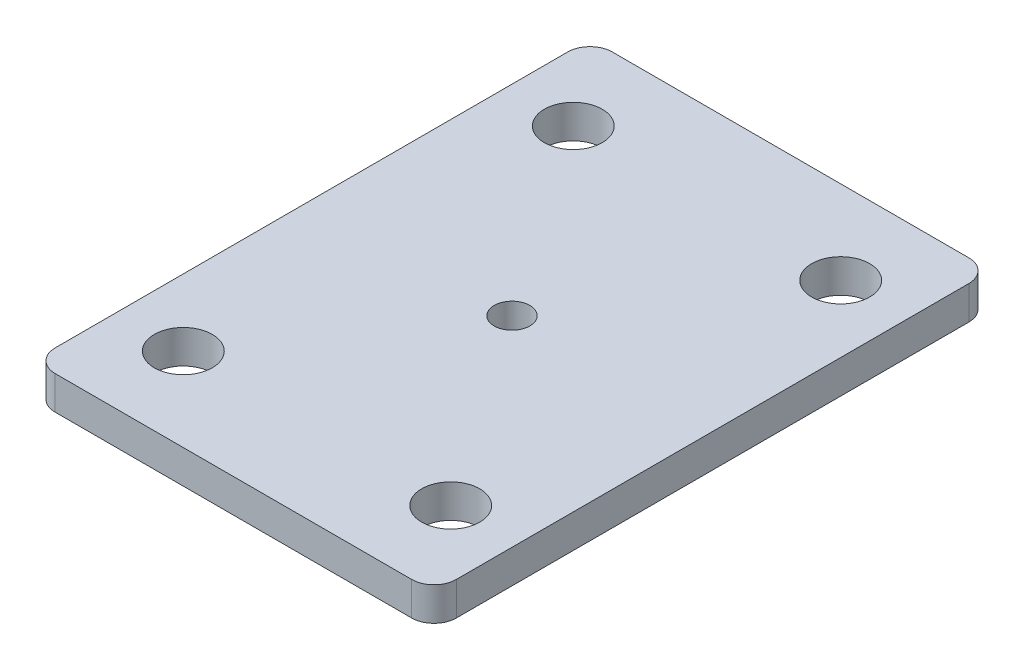
ISO-10303-21;
HEADER;
FILE_DESCRIPTION(('STEP AP214'),'2;1');
FILE_NAME('part.step','',(''),(''),'','','');
FILE_SCHEMA(('AUTOMOTIVE_DESIGN { 1 0 10303 214 1 1 1 1 }'));
ENDSEC;
DATA;
#1=APPLICATION_CONTEXT('core data for automotive mechanical design processes');
#2=APPLICATION_PROTOCOL_DEFINITION('international standard','automotive_design',2000,#1);
#3=PRODUCT_CONTEXT('',#1,'mechanical');
#4=PRODUCT('Part','Part','',(#3));
#5=PRODUCT_RELATED_PRODUCT_CATEGORY('part','',(#4));
#6=PRODUCT_DEFINITION_FORMATION('','',#4);
#7=PRODUCT_DEFINITION_CONTEXT('part definition',#1,'design');
#8=PRODUCT_DEFINITION('design','',#6,#7);
#9=PRODUCT_DEFINITION_SHAPE('','',#8);
#10=(LENGTH_UNIT() NAMED_UNIT(*) SI_UNIT(.MILLI.,.METRE.));
#11=(NAMED_UNIT(*) PLANE_ANGLE_UNIT() SI_UNIT($,.RADIAN.));
#12=(NAMED_UNIT(*) SI_UNIT($,.STERADIAN.) SOLID_ANGLE_UNIT());
#13=UNCERTAINTY_MEASURE_WITH_UNIT(LENGTH_MEASURE(1.E-05),#10,'distance_accuracy_value','');
#14=(GEOMETRIC_REPRESENTATION_CONTEXT(3) GLOBAL_UNCERTAINTY_ASSIGNED_CONTEXT((#13)) GLOBAL_UNIT_ASSIGNED_CONTEXT((#10,
#11,#12)) REPRESENTATION_CONTEXT('',''));
#15=CARTESIAN_POINT('',(0.,0.,0.));
#16=DIRECTION('',(0.,0.,1.));
#17=DIRECTION('',(1.,0.,0.));
#18=AXIS2_PLACEMENT_3D('',#15,#16,#17);
#19=CARTESIAN_POINT('',(0.,3.,0.));
#20=DIRECTION('',(0.,1.,0.));
#21=DIRECTION('',(0.,0.,1.));
#22=AXIS2_PLACEMENT_3D('',#19,#20,#21);
#23=PLANE('',#22);
#24=CARTESIAN_POINT('',(0.,3.,0.));
#25=DIRECTION('',(0.,1.,0.));
#26=DIRECTION('',(0.,0.,1.));
#27=AXIS2_PLACEMENT_3D('',#24,#25,#26);
#28=CIRCLE('',#27,1.6);
#29=CARTESIAN_POINT('',(0.,3.,1.6));
#30=VERTEX_POINT('',#29);
#31=EDGE_CURVE('E207',#30,#30,#28,.T.);
#32=ORIENTED_EDGE('',*,*,#31,.F.);
#33=EDGE_LOOP('',(#32));
#34=FACE_BOUND('',#33,.T.);
#35=CARTESIAN_POINT('',(-12.,3.,17.5));
#36=DIRECTION('',(0.,1.,0.));
#37=DIRECTION('',(0.,0.,1.));
#38=AXIS2_PLACEMENT_3D('',#35,#36,#37);
#39=CIRCLE('',#38,2.6);
#40=CARTESIAN_POINT('',(-12.,3.,20.1));
#41=VERTEX_POINT('',#40);
#42=EDGE_CURVE('E193',#41,#41,#39,.T.);
#43=ORIENTED_EDGE('',*,*,#42,.F.);
#44=EDGE_LOOP('',(#43));
#45=FACE_BOUND('',#44,.T.);
#46=CARTESIAN_POINT('',(-12.,3.,-17.5));
#47=DIRECTION('',(0.,1.,0.));
#48=DIRECTION('',(0.,0.,1.));
#49=AXIS2_PLACEMENT_3D('',#46,#47,#48);
#50=CIRCLE('',#49,2.6);
#51=CARTESIAN_POINT('',(-12.,3.,-14.9));
#52=VERTEX_POINT('',#51);
#53=EDGE_CURVE('E138',#52,#52,#50,.T.);
#54=ORIENTED_EDGE('',*,*,#53,.F.);
#55=EDGE_LOOP('',(#54));
#56=FACE_BOUND('',#55,.T.);
#57=DIRECTION('',(0.,0.,-1.));
#58=VECTOR('',#57,1.);
#59=CARTESIAN_POINT('',(18.,3.,-25.));
#60=LINE('',#59,#58);
#61=CARTESIAN_POINT('',(18.,3.,23.));
#62=VERTEX_POINT('',#61);
#63=CARTESIAN_POINT('',(18.,3.,-23.));
#64=VERTEX_POINT('',#63);
#65=EDGE_CURVE('E143',#62,#64,#60,.T.);
#66=ORIENTED_EDGE('',*,*,#65,.T.);
#67=CARTESIAN_POINT('',(16.,3.,-23.));
#68=DIRECTION('',(0.,1.,0.));
#69=DIRECTION('',(0.,0.,1.));
#70=AXIS2_PLACEMENT_3D('',#67,#68,#69);
#71=CIRCLE('',#70,2.);
#72=CARTESIAN_POINT('',(16.,3.,-25.));
#73=VERTEX_POINT('',#72);
#74=EDGE_CURVE('E158',#64,#73,#71,.T.);
#75=ORIENTED_EDGE('',*,*,#74,.T.);
#76=DIRECTION('',(-1.,0.,0.));
#77=VECTOR('',#76,1.);
#78=CARTESIAN_POINT('',(-18.,3.,-25.));
#79=LINE('',#78,#77);
#80=CARTESIAN_POINT('',(-16.,3.,-25.));
#81=VERTEX_POINT('',#80);
#82=EDGE_CURVE('E125',#73,#81,#79,.T.);
#83=ORIENTED_EDGE('',*,*,#82,.T.);
#84=CARTESIAN_POINT('',(-16.,3.,-23.));
#85=DIRECTION('',(0.,1.,0.));
#86=DIRECTION('',(0.,0.,1.));
#87=AXIS2_PLACEMENT_3D('',#84,#85,#86);
#88=CIRCLE('',#87,2.);
#89=CARTESIAN_POINT('',(-18.,3.,-23.));
#90=VERTEX_POINT('',#89);
#91=EDGE_CURVE('E156',#81,#90,#88,.T.);
#92=ORIENTED_EDGE('',*,*,#91,.T.);
#93=DIRECTION('',(0.,0.,1.));
#94=VECTOR('',#93,1.);
#95=CARTESIAN_POINT('',(-18.,3.,-25.));
#96=LINE('',#95,#94);
#97=CARTESIAN_POINT('',(-18.,3.,23.));
#98=VERTEX_POINT('',#97);
#99=EDGE_CURVE('E170',#90,#98,#96,.T.);
#100=ORIENTED_EDGE('',*,*,#99,.T.);
#101=CARTESIAN_POINT('',(-16.,3.,23.));
#102=DIRECTION('',(0.,1.,0.));
#103=DIRECTION('',(0.,0.,1.));
#104=AXIS2_PLACEMENT_3D('',#101,#102,#103);
#105=CIRCLE('',#104,2.);
#106=CARTESIAN_POINT('',(-16.,3.,25.));
#107=VERTEX_POINT('',#106);
#108=EDGE_CURVE('E60',#98,#107,#105,.T.);
#109=ORIENTED_EDGE('',*,*,#108,.T.);
#110=DIRECTION('',(1.,0.,0.));
#111=VECTOR('',#110,1.);
#112=CARTESIAN_POINT('',(-18.,3.,25.));
#113=LINE('',#112,#111);
#114=CARTESIAN_POINT('',(16.,3.,25.));
#115=VERTEX_POINT('',#114);
#116=EDGE_CURVE('E144',#107,#115,#113,.T.);
#117=ORIENTED_EDGE('',*,*,#116,.T.);
#118=CARTESIAN_POINT('',(16.,3.,23.));
#119=DIRECTION('',(0.,1.,0.));
#120=DIRECTION('',(0.,0.,1.));
#121=AXIS2_PLACEMENT_3D('',#118,#119,#120);
#122=CIRCLE('',#121,2.);
#123=EDGE_CURVE('E153',#115,#62,#122,.T.);
#124=ORIENTED_EDGE('',*,*,#123,.T.);
#125=EDGE_LOOP('',(#66,#75,#83,#92,#100,#109,#117,#124));
#126=FACE_BOUND('',#125,.T.);
#127=CARTESIAN_POINT('',(12.,3.,-17.5));
#128=DIRECTION('',(0.,1.,0.));
#129=DIRECTION('',(0.,0.,1.));
#130=AXIS2_PLACEMENT_3D('',#127,#128,#129);
#131=CIRCLE('',#130,2.6);
#132=CARTESIAN_POINT('',(12.,3.,-14.9));
#133=VERTEX_POINT('',#132);
#134=EDGE_CURVE('E187',#133,#133,#131,.T.);
#135=ORIENTED_EDGE('',*,*,#134,.F.);
#136=EDGE_LOOP('',(#135));
#137=FACE_BOUND('',#136,.T.);
#138=CARTESIAN_POINT('',(12.,3.,17.5));
#139=DIRECTION('',(0.,1.,0.));
#140=DIRECTION('',(0.,0.,1.));
#141=AXIS2_PLACEMENT_3D('',#138,#139,#140);
#142=CIRCLE('',#141,2.6);
#143=CARTESIAN_POINT('',(12.,3.,20.1));
#144=VERTEX_POINT('',#143);
#145=EDGE_CURVE('E199',#144,#144,#142,.T.);
#146=ORIENTED_EDGE('',*,*,#145,.F.);
#147=EDGE_LOOP('',(#146));
#148=FACE_BOUND('',#147,.T.);
#149=ADVANCED_FACE('F38',(#34,#45,#56,#126,#137,#148),#23,.T.);
#150=CARTESIAN_POINT('',(0.,0.,0.));
#151=DIRECTION('',(0.,1.,0.));
#152=DIRECTION('',(0.,0.,1.));
#153=AXIS2_PLACEMENT_3D('',#150,#151,#152);
#154=PLANE('',#153);
#155=CARTESIAN_POINT('',(0.,0.,0.));
#156=DIRECTION('',(0.,1.,0.));
#157=DIRECTION('',(0.,0.,1.));
#158=AXIS2_PLACEMENT_3D('',#155,#156,#157);
#159=CIRCLE('',#158,1.6);
#160=CARTESIAN_POINT('',(0.,0.,1.6));
#161=VERTEX_POINT('',#160);
#162=EDGE_CURVE('E42',#161,#161,#159,.T.);
#163=ORIENTED_EDGE('',*,*,#162,.T.);
#164=EDGE_LOOP('',(#163));
#165=FACE_BOUND('',#164,.T.);
#166=DIRECTION('',(-1.,0.,0.));
#167=VECTOR('',#166,1.);
#168=CARTESIAN_POINT('',(-18.,0.,-25.));
#169=LINE('',#168,#167);
#170=CARTESIAN_POINT('',(16.,0.,-25.));
#171=VERTEX_POINT('',#170);
#172=CARTESIAN_POINT('',(-16.,0.,-25.));
#173=VERTEX_POINT('',#172);
#174=EDGE_CURVE('E122',#171,#173,#169,.T.);
#175=ORIENTED_EDGE('',*,*,#174,.F.);
#176=CARTESIAN_POINT('',(16.,0.,-23.));
#177=DIRECTION('',(0.,1.,0.));
#178=DIRECTION('',(0.,0.,1.));
#179=AXIS2_PLACEMENT_3D('',#176,#177,#178);
#180=CIRCLE('',#179,2.);
#181=CARTESIAN_POINT('',(18.,0.,-23.));
#182=VERTEX_POINT('',#181);
#183=EDGE_CURVE('E105',#171,#182,#180,.F.);
#184=ORIENTED_EDGE('',*,*,#183,.T.);
#185=DIRECTION('',(0.,0.,-1.));
#186=VECTOR('',#185,1.);
#187=CARTESIAN_POINT('',(18.,0.,-25.));
#188=LINE('',#187,#186);
#189=CARTESIAN_POINT('',(18.,0.,23.));
#190=VERTEX_POINT('',#189);
#191=EDGE_CURVE('E133',#190,#182,#188,.T.);
#192=ORIENTED_EDGE('',*,*,#191,.F.);
#193=CARTESIAN_POINT('',(16.,0.,23.));
#194=DIRECTION('',(0.,1.,0.));
#195=DIRECTION('',(0.,0.,1.));
#196=AXIS2_PLACEMENT_3D('',#193,#194,#195);
#197=CIRCLE('',#196,2.);
#198=CARTESIAN_POINT('',(16.,0.,25.));
#199=VERTEX_POINT('',#198);
#200=EDGE_CURVE('E126',#190,#199,#197,.F.);
#201=ORIENTED_EDGE('',*,*,#200,.T.);
#202=DIRECTION('',(1.,0.,0.));
#203=VECTOR('',#202,1.);
#204=CARTESIAN_POINT('',(-18.,0.,25.));
#205=LINE('',#204,#203);
#206=CARTESIAN_POINT('',(-16.,0.,25.));
#207=VERTEX_POINT('',#206);
#208=EDGE_CURVE('E136',#207,#199,#205,.T.);
#209=ORIENTED_EDGE('',*,*,#208,.F.);
#210=CARTESIAN_POINT('',(-16.,0.,23.));
#211=DIRECTION('',(0.,1.,0.));
#212=DIRECTION('',(0.,0.,1.));
#213=AXIS2_PLACEMENT_3D('',#210,#211,#212);
#214=CIRCLE('',#213,2.);
#215=CARTESIAN_POINT('',(-18.,0.,23.));
#216=VERTEX_POINT('',#215);
#217=EDGE_CURVE('E147',#207,#216,#214,.F.);
#218=ORIENTED_EDGE('',*,*,#217,.T.);
#219=DIRECTION('',(0.,0.,1.));
#220=VECTOR('',#219,1.);
#221=CARTESIAN_POINT('',(-18.,0.,-25.));
#222=LINE('',#221,#220);
#223=CARTESIAN_POINT('',(-18.,0.,-23.));
#224=VERTEX_POINT('',#223);
#225=EDGE_CURVE('E132',#224,#216,#222,.T.);
#226=ORIENTED_EDGE('',*,*,#225,.F.);
#227=CARTESIAN_POINT('',(-16.,0.,-23.));
#228=DIRECTION('',(0.,1.,0.));
#229=DIRECTION('',(0.,0.,1.));
#230=AXIS2_PLACEMENT_3D('',#227,#228,#229);
#231=CIRCLE('',#230,2.);
#232=EDGE_CURVE('E116',#224,#173,#231,.F.);
#233=ORIENTED_EDGE('',*,*,#232,.T.);
#234=EDGE_LOOP('',(#175,#184,#192,#201,#209,#218,#226,#233));
#235=FACE_BOUND('',#234,.T.);
#236=CARTESIAN_POINT('',(-12.,0.,-17.5));
#237=DIRECTION('',(0.,1.,0.));
#238=DIRECTION('',(0.,0.,1.));
#239=AXIS2_PLACEMENT_3D('',#236,#237,#238);
#240=CIRCLE('',#239,2.6);
#241=CARTESIAN_POINT('',(-12.,0.,-14.9));
#242=VERTEX_POINT('',#241);
#243=EDGE_CURVE('E184',#242,#242,#240,.T.);
#244=ORIENTED_EDGE('',*,*,#243,.T.);
#245=EDGE_LOOP('',(#244));
#246=FACE_BOUND('',#245,.T.);
#247=CARTESIAN_POINT('',(12.,0.,-17.5));
#248=DIRECTION('',(0.,1.,0.));
#249=DIRECTION('',(0.,0.,1.));
#250=AXIS2_PLACEMENT_3D('',#247,#248,#249);
#251=CIRCLE('',#250,2.6);
#252=CARTESIAN_POINT('',(12.,0.,-14.9));
#253=VERTEX_POINT('',#252);
#254=EDGE_CURVE('E190',#253,#253,#251,.T.);
#255=ORIENTED_EDGE('',*,*,#254,.T.);
#256=EDGE_LOOP('',(#255));
#257=FACE_BOUND('',#256,.T.);
#258=CARTESIAN_POINT('',(-12.,0.,17.5));
#259=DIRECTION('',(0.,1.,0.));
#260=DIRECTION('',(0.,0.,1.));
#261=AXIS2_PLACEMENT_3D('',#258,#259,#260);
#262=CIRCLE('',#261,2.6);
#263=CARTESIAN_POINT('',(-12.,0.,20.1));
#264=VERTEX_POINT('',#263);
#265=EDGE_CURVE('E196',#264,#264,#262,.T.);
#266=ORIENTED_EDGE('',*,*,#265,.T.);
#267=EDGE_LOOP('',(#266));
#268=FACE_BOUND('',#267,.T.);
#269=CARTESIAN_POINT('',(12.,0.,17.5));
#270=DIRECTION('',(0.,1.,0.));
#271=DIRECTION('',(0.,0.,1.));
#272=AXIS2_PLACEMENT_3D('',#269,#270,#271);
#273=CIRCLE('',#272,2.6);
#274=CARTESIAN_POINT('',(12.,0.,20.1));
#275=VERTEX_POINT('',#274);
#276=EDGE_CURVE('E202',#275,#275,#273,.T.);
#277=ORIENTED_EDGE('',*,*,#276,.T.);
#278=EDGE_LOOP('',(#277));
#279=FACE_BOUND('',#278,.T.);
#280=ADVANCED_FACE('F129',(#165,#235,#246,#257,#268,#279),#154,.F.);
#281=CARTESIAN_POINT('',(18.,3.,-25.));
#282=DIRECTION('',(-1.,0.,0.));
#283=DIRECTION('',(0.,0.,1.));
#284=AXIS2_PLACEMENT_3D('',#281,#282,#283);
#285=PLANE('',#284);
#286=ORIENTED_EDGE('',*,*,#191,.T.);
#287=DIRECTION('',(0.,-1.,0.));
#288=VECTOR('',#287,1.);
#289=CARTESIAN_POINT('',(18.,3.,-23.));
#290=LINE('',#289,#288);
#291=EDGE_CURVE('E110',#182,#64,#290,.F.);
#292=ORIENTED_EDGE('',*,*,#291,.T.);
#293=ORIENTED_EDGE('',*,*,#65,.F.);
#294=DIRECTION('',(0.,-1.,0.));
#295=VECTOR('',#294,1.);
#296=CARTESIAN_POINT('',(18.,3.,23.));
#297=LINE('',#296,#295);
#298=EDGE_CURVE('E115',#62,#190,#297,.T.);
#299=ORIENTED_EDGE('',*,*,#298,.T.);
#300=EDGE_LOOP('',(#286,#292,#293,#299));
#301=FACE_BOUND('',#300,.T.);
#302=ADVANCED_FACE('F229',(#301),#285,.F.);
#303=CARTESIAN_POINT('',(-18.,3.,-25.));
#304=DIRECTION('',(0.,0.,1.));
#305=DIRECTION('',(1.,0.,0.));
#306=AXIS2_PLACEMENT_3D('',#303,#304,#305);
#307=PLANE('',#306);
#308=ORIENTED_EDGE('',*,*,#82,.F.);
#309=DIRECTION('',(0.,-1.,0.));
#310=VECTOR('',#309,1.);
#311=CARTESIAN_POINT('',(16.,3.,-25.));
#312=LINE('',#311,#310);
#313=EDGE_CURVE('E109',#73,#171,#312,.T.);
#314=ORIENTED_EDGE('',*,*,#313,.T.);
#315=ORIENTED_EDGE('',*,*,#174,.T.);
#316=DIRECTION('',(0.,-1.,0.));
#317=VECTOR('',#316,1.);
#318=CARTESIAN_POINT('',(-16.,3.,-25.));
#319=LINE('',#318,#317);
#320=EDGE_CURVE('E127',#173,#81,#319,.F.);
#321=ORIENTED_EDGE('',*,*,#320,.T.);
#322=EDGE_LOOP('',(#308,#314,#315,#321));
#323=FACE_BOUND('',#322,.T.);
#324=ADVANCED_FACE('F121',(#323),#307,.F.);
#325=CARTESIAN_POINT('',(-18.,3.,-25.));
#326=DIRECTION('',(1.,0.,0.));
#327=DIRECTION('',(0.,0.,-1.));
#328=AXIS2_PLACEMENT_3D('',#325,#326,#327);
#329=PLANE('',#328);
#330=ORIENTED_EDGE('',*,*,#99,.F.);
#331=DIRECTION('',(0.,-1.,0.));
#332=VECTOR('',#331,1.);
#333=CARTESIAN_POINT('',(-18.,3.,-23.));
#334=LINE('',#333,#332);
#335=EDGE_CURVE('E162',#90,#224,#334,.T.);
#336=ORIENTED_EDGE('',*,*,#335,.T.);
#337=ORIENTED_EDGE('',*,*,#225,.T.);
#338=DIRECTION('',(0.,-1.,0.));
#339=VECTOR('',#338,1.);
#340=CARTESIAN_POINT('',(-18.,3.,23.));
#341=LINE('',#340,#339);
#342=EDGE_CURVE('E160',#216,#98,#341,.F.);
#343=ORIENTED_EDGE('',*,*,#342,.T.);
#344=EDGE_LOOP('',(#330,#336,#337,#343));
#345=FACE_BOUND('',#344,.T.);
#346=ADVANCED_FACE('F168',(#345),#329,.F.);
#347=CARTESIAN_POINT('',(-18.,3.,25.));
#348=DIRECTION('',(0.,0.,-1.));
#349=DIRECTION('',(-1.,0.,0.));
#350=AXIS2_PLACEMENT_3D('',#347,#348,#349);
#351=PLANE('',#350);
#352=ORIENTED_EDGE('',*,*,#116,.F.);
#353=DIRECTION('',(0.,-1.,0.));
#354=VECTOR('',#353,1.);
#355=CARTESIAN_POINT('',(-16.,3.,25.));
#356=LINE('',#355,#354);
#357=EDGE_CURVE('E11',#107,#207,#356,.T.);
#358=ORIENTED_EDGE('',*,*,#357,.T.);
#359=ORIENTED_EDGE('',*,*,#208,.T.);
#360=DIRECTION('',(0.,-1.,0.));
#361=VECTOR('',#360,1.);
#362=CARTESIAN_POINT('',(16.,3.,25.));
#363=LINE('',#362,#361);
#364=EDGE_CURVE('E47',#199,#115,#363,.F.);
#365=ORIENTED_EDGE('',*,*,#364,.T.);
#366=EDGE_LOOP('',(#352,#358,#359,#365));
#367=FACE_BOUND('',#366,.T.);
#368=ADVANCED_FACE('F177',(#367),#351,.F.);
#369=CARTESIAN_POINT('',(-12.,3.,-17.5));
#370=DIRECTION('',(0.,-1.,0.));
#371=DIRECTION('',(0.,0.,-1.));
#372=AXIS2_PLACEMENT_3D('',#369,#370,#371);
#373=CYLINDRICAL_SURFACE('',#372,2.6);
#374=ORIENTED_EDGE('',*,*,#53,.T.);
#375=EDGE_LOOP('',(#374));
#376=FACE_BOUND('',#375,.T.);
#377=ORIENTED_EDGE('',*,*,#243,.F.);
#378=EDGE_LOOP('',(#377));
#379=FACE_BOUND('',#378,.T.);
#380=ADVANCED_FACE('F233',(#376,#379),#373,.F.);
#381=CARTESIAN_POINT('',(12.,3.,-17.5));
#382=DIRECTION('',(0.,-1.,0.));
#383=DIRECTION('',(0.,0.,-1.));
#384=AXIS2_PLACEMENT_3D('',#381,#382,#383);
#385=CYLINDRICAL_SURFACE('',#384,2.6);
#386=ORIENTED_EDGE('',*,*,#134,.T.);
#387=EDGE_LOOP('',(#386));
#388=FACE_BOUND('',#387,.T.);
#389=ORIENTED_EDGE('',*,*,#254,.F.);
#390=EDGE_LOOP('',(#389));
#391=FACE_BOUND('',#390,.T.);
#392=ADVANCED_FACE('F299',(#388,#391),#385,.F.);
#393=CARTESIAN_POINT('',(-12.,3.,17.5));
#394=DIRECTION('',(0.,-1.,0.));
#395=DIRECTION('',(0.,0.,-1.));
#396=AXIS2_PLACEMENT_3D('',#393,#394,#395);
#397=CYLINDRICAL_SURFACE('',#396,2.6);
#398=ORIENTED_EDGE('',*,*,#42,.T.);
#399=EDGE_LOOP('',(#398));
#400=FACE_BOUND('',#399,.T.);
#401=ORIENTED_EDGE('',*,*,#265,.F.);
#402=EDGE_LOOP('',(#401));
#403=FACE_BOUND('',#402,.T.);
#404=ADVANCED_FACE('F306',(#400,#403),#397,.F.);
#405=CARTESIAN_POINT('',(12.,3.,17.5));
#406=DIRECTION('',(0.,-1.,0.));
#407=DIRECTION('',(0.,0.,-1.));
#408=AXIS2_PLACEMENT_3D('',#405,#406,#407);
#409=CYLINDRICAL_SURFACE('',#408,2.6);
#410=ORIENTED_EDGE('',*,*,#145,.T.);
#411=EDGE_LOOP('',(#410));
#412=FACE_BOUND('',#411,.T.);
#413=ORIENTED_EDGE('',*,*,#276,.F.);
#414=EDGE_LOOP('',(#413));
#415=FACE_BOUND('',#414,.T.);
#416=ADVANCED_FACE('F248',(#412,#415),#409,.F.);
#417=CARTESIAN_POINT('',(16.,3.,-23.));
#418=DIRECTION('',(0.,-1.,0.));
#419=DIRECTION('',(0.,0.,-1.));
#420=AXIS2_PLACEMENT_3D('',#417,#418,#419);
#421=CYLINDRICAL_SURFACE('',#420,2.);
#422=ORIENTED_EDGE('',*,*,#74,.F.);
#423=ORIENTED_EDGE('',*,*,#291,.F.);
#424=ORIENTED_EDGE('',*,*,#183,.F.);
#425=ORIENTED_EDGE('',*,*,#313,.F.);
#426=EDGE_LOOP('',(#422,#423,#424,#425));
#427=FACE_BOUND('',#426,.T.);
#428=ADVANCED_FACE('F108',(#427),#421,.T.);
#429=CARTESIAN_POINT('',(-16.,3.,-23.));
#430=DIRECTION('',(0.,-1.,0.));
#431=DIRECTION('',(0.,0.,-1.));
#432=AXIS2_PLACEMENT_3D('',#429,#430,#431);
#433=CYLINDRICAL_SURFACE('',#432,2.);
#434=ORIENTED_EDGE('',*,*,#91,.F.);
#435=ORIENTED_EDGE('',*,*,#320,.F.);
#436=ORIENTED_EDGE('',*,*,#232,.F.);
#437=ORIENTED_EDGE('',*,*,#335,.F.);
#438=EDGE_LOOP('',(#434,#435,#436,#437));
#439=FACE_BOUND('',#438,.T.);
#440=ADVANCED_FACE('F247',(#439),#433,.T.);
#441=CARTESIAN_POINT('',(-16.,3.,23.));
#442=DIRECTION('',(0.,-1.,0.));
#443=DIRECTION('',(0.,0.,-1.));
#444=AXIS2_PLACEMENT_3D('',#441,#442,#443);
#445=CYLINDRICAL_SURFACE('',#444,2.);
#446=ORIENTED_EDGE('',*,*,#108,.F.);
#447=ORIENTED_EDGE('',*,*,#342,.F.);
#448=ORIENTED_EDGE('',*,*,#217,.F.);
#449=ORIENTED_EDGE('',*,*,#357,.F.);
#450=EDGE_LOOP('',(#446,#447,#448,#449));
#451=FACE_BOUND('',#450,.T.);
#452=ADVANCED_FACE('F176',(#451),#445,.T.);
#453=CARTESIAN_POINT('',(16.,3.,23.));
#454=DIRECTION('',(0.,-1.,0.));
#455=DIRECTION('',(0.,0.,-1.));
#456=AXIS2_PLACEMENT_3D('',#453,#454,#455);
#457=CYLINDRICAL_SURFACE('',#456,2.);
#458=ORIENTED_EDGE('',*,*,#123,.F.);
#459=ORIENTED_EDGE('',*,*,#364,.F.);
#460=ORIENTED_EDGE('',*,*,#200,.F.);
#461=ORIENTED_EDGE('',*,*,#298,.F.);
#462=EDGE_LOOP('',(#458,#459,#460,#461));
#463=FACE_BOUND('',#462,.T.);
#464=ADVANCED_FACE('F40',(#463),#457,.T.);
#465=CARTESIAN_POINT('',(0.,-7.,0.));
#466=DIRECTION('',(0.,1.,0.));
#467=DIRECTION('',(0.,0.,1.));
#468=AXIS2_PLACEMENT_3D('',#465,#466,#467);
#469=CYLINDRICAL_SURFACE('',#468,1.6);
#470=ORIENTED_EDGE('',*,*,#31,.T.);
#471=EDGE_LOOP('',(#470));
#472=FACE_BOUND('',#471,.T.);
#473=ORIENTED_EDGE('',*,*,#162,.F.);
#474=EDGE_LOOP('',(#473));
#475=FACE_BOUND('',#474,.T.);
#476=ADVANCED_FACE('F215',(#472,#475),#469,.F.);
#477=CLOSED_SHELL('',(#149,#280,#302,#324,#346,#368,#380,#392,#404,#416,#428,#440,#452,#464,#476));
#478=MANIFOLD_SOLID_BREP('B2',#477);
#479=ADVANCED_BREP_SHAPE_REPRESENTATION('',(#18,#478),#14);
#480=SHAPE_DEFINITION_REPRESENTATION(#9,#479);
ENDSEC;
END-ISO-10303-21;
